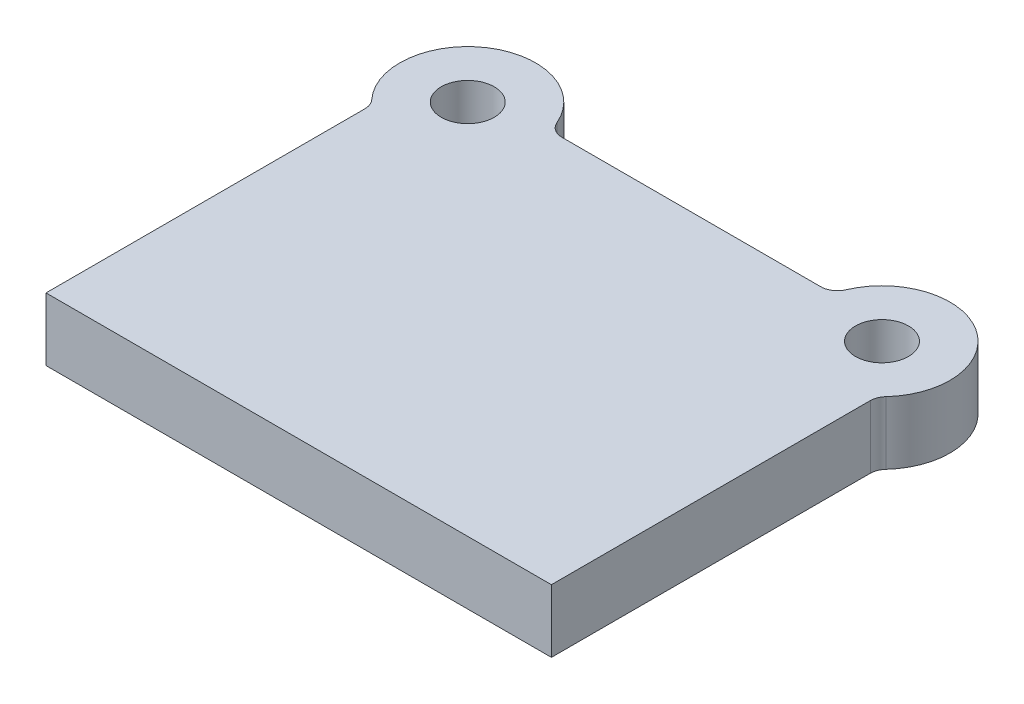
ISO-10303-21;
HEADER;
FILE_DESCRIPTION(('STEP AP214'),'2;1');
FILE_NAME('part.step','',(''),(''),'','','');
FILE_SCHEMA(('AUTOMOTIVE_DESIGN { 1 0 10303 214 1 1 1 1 }'));
ENDSEC;
DATA;
#1=APPLICATION_CONTEXT('core data for automotive mechanical design processes');
#2=APPLICATION_PROTOCOL_DEFINITION('international standard','automotive_design',2000,#1);
#3=PRODUCT_CONTEXT('',#1,'mechanical');
#4=PRODUCT('Part','Part','',(#3));
#5=PRODUCT_RELATED_PRODUCT_CATEGORY('part','',(#4));
#6=PRODUCT_DEFINITION_FORMATION('','',#4);
#7=PRODUCT_DEFINITION_CONTEXT('part definition',#1,'design');
#8=PRODUCT_DEFINITION('design','',#6,#7);
#9=PRODUCT_DEFINITION_SHAPE('','',#8);
#10=(LENGTH_UNIT() NAMED_UNIT(*) SI_UNIT(.MILLI.,.METRE.));
#11=(NAMED_UNIT(*) PLANE_ANGLE_UNIT() SI_UNIT($,.RADIAN.));
#12=(NAMED_UNIT(*) SI_UNIT($,.STERADIAN.) SOLID_ANGLE_UNIT());
#13=UNCERTAINTY_MEASURE_WITH_UNIT(LENGTH_MEASURE(1.E-05),#10,'distance_accuracy_value','');
#14=(GEOMETRIC_REPRESENTATION_CONTEXT(3) GLOBAL_UNCERTAINTY_ASSIGNED_CONTEXT((#13)) GLOBAL_UNIT_ASSIGNED_CONTEXT((#10,
#11,#12)) REPRESENTATION_CONTEXT('',''));
#15=CARTESIAN_POINT('',(0.,0.,0.));
#16=DIRECTION('',(0.,0.,1.));
#17=DIRECTION('',(1.,0.,0.));
#18=AXIS2_PLACEMENT_3D('',#15,#16,#17);
#19=CARTESIAN_POINT('',(-125.,38.,-227.));
#20=DIRECTION('',(0.,1.,0.));
#21=DIRECTION('',(0.,0.,1.));
#22=AXIS2_PLACEMENT_3D('',#19,#20,#21);
#23=PLANE('',#22);
#24=CARTESIAN_POINT('',(-125.,38.,-227.));
#25=DIRECTION('',(0.,1.,0.));
#26=DIRECTION('',(0.,0.,1.));
#27=AXIS2_PLACEMENT_3D('',#24,#25,#26);
#28=CIRCLE('',#27,16.);
#29=CARTESIAN_POINT('',(-125.,38.,-211.));
#30=VERTEX_POINT('',#29);
#31=EDGE_CURVE('E195',#30,#30,#28,.T.);
#32=ORIENTED_EDGE('',*,*,#31,.F.);
#33=EDGE_LOOP('',(#32));
#34=FACE_BOUND('',#33,.T.);
#35=CARTESIAN_POINT('',(-125.,38.,-227.));
#36=DIRECTION('',(0.,1.,0.));
#37=DIRECTION('',(0.,0.,1.));
#38=AXIS2_PLACEMENT_3D('',#35,#36,#37);
#39=CIRCLE('',#38,41.);
#40=CARTESIAN_POINT('',(-87.2841671893854,38.,-243.078431372549));
#41=VERTEX_POINT('',#40);
#42=CARTESIAN_POINT('',(-155.147058823529,38.,-199.212325676828));
#43=VERTEX_POINT('',#42);
#44=EDGE_CURVE('E141',#41,#43,#39,.T.);
#45=ORIENTED_EDGE('',*,*,#44,.T.);
#46=CARTESIAN_POINT('',(-162.5,38.,-192.434844134591));
#47=DIRECTION('',(0.,1.,0.));
#48=DIRECTION('',(0.,0.,1.));
#49=AXIS2_PLACEMENT_3D('',#46,#47,#48);
#50=CIRCLE('',#49,10.);
#51=CARTESIAN_POINT('',(-152.5,38.,-192.434844134591));
#52=VERTEX_POINT('',#51);
#53=EDGE_CURVE('E117',#43,#52,#50,.F.);
#54=ORIENTED_EDGE('',*,*,#53,.T.);
#55=DIRECTION('',(0.,0.,1.));
#56=VECTOR('',#55,1.);
#57=CARTESIAN_POINT('',(-152.5,38.,0.));
#58=LINE('',#57,#56);
#59=CARTESIAN_POINT('',(-152.5,38.,0.));
#60=VERTEX_POINT('',#59);
#61=EDGE_CURVE('E109',#52,#60,#58,.T.);
#62=ORIENTED_EDGE('',*,*,#61,.T.);
#63=DIRECTION('',(1.,0.,0.));
#64=VECTOR('',#63,1.);
#65=CARTESIAN_POINT('',(152.5,38.,0.));
#66=LINE('',#65,#64);
#67=CARTESIAN_POINT('',(152.5,38.,0.));
#68=VERTEX_POINT('',#67);
#69=EDGE_CURVE('E114',#60,#68,#66,.T.);
#70=ORIENTED_EDGE('',*,*,#69,.T.);
#71=DIRECTION('',(0.,0.,-1.));
#72=VECTOR('',#71,1.);
#73=CARTESIAN_POINT('',(152.5,38.,0.));
#74=LINE('',#73,#72);
#75=CARTESIAN_POINT('',(152.5,38.,-192.434844134591));
#76=VERTEX_POINT('',#75);
#77=EDGE_CURVE('E131',#68,#76,#74,.T.);
#78=ORIENTED_EDGE('',*,*,#77,.T.);
#79=CARTESIAN_POINT('',(162.5,38.,-192.434844134591));
#80=DIRECTION('',(0.,1.,0.));
#81=DIRECTION('',(0.,0.,1.));
#82=AXIS2_PLACEMENT_3D('',#79,#80,#81);
#83=CIRCLE('',#82,10.);
#84=CARTESIAN_POINT('',(155.147058823529,38.,-199.212325676828));
#85=VERTEX_POINT('',#84);
#86=EDGE_CURVE('E162',#76,#85,#83,.F.);
#87=ORIENTED_EDGE('',*,*,#86,.T.);
#88=CARTESIAN_POINT('',(125.,38.,-227.));
#89=DIRECTION('',(0.,1.,0.));
#90=DIRECTION('',(0.,0.,-1.));
#91=AXIS2_PLACEMENT_3D('',#88,#89,#90);
#92=CIRCLE('',#91,41.);
#93=CARTESIAN_POINT('',(87.2841671893854,38.,-243.078431372549));
#94=VERTEX_POINT('',#93);
#95=EDGE_CURVE('E189',#85,#94,#92,.T.);
#96=ORIENTED_EDGE('',*,*,#95,.T.);
#97=CARTESIAN_POINT('',(78.0851835770404,38.,-247.));
#98=DIRECTION('',(0.,1.,0.));
#99=DIRECTION('',(0.,0.,1.));
#100=AXIS2_PLACEMENT_3D('',#97,#98,#99);
#101=CIRCLE('',#100,10.);
#102=CARTESIAN_POINT('',(78.0851835770404,38.,-237.));
#103=VERTEX_POINT('',#102);
#104=EDGE_CURVE('E55',#94,#103,#101,.F.);
#105=ORIENTED_EDGE('',*,*,#104,.T.);
#106=DIRECTION('',(-1.,0.,0.));
#107=VECTOR('',#106,1.);
#108=CARTESIAN_POINT('',(85.2382092958579,38.,-237.));
#109=LINE('',#108,#107);
#110=CARTESIAN_POINT('',(-78.0851835770404,38.,-237.));
#111=VERTEX_POINT('',#110);
#112=EDGE_CURVE('E184',#103,#111,#109,.T.);
#113=ORIENTED_EDGE('',*,*,#112,.T.);
#114=CARTESIAN_POINT('',(-78.0851835770404,38.,-247.));
#115=DIRECTION('',(0.,1.,0.));
#116=DIRECTION('',(0.,0.,1.));
#117=AXIS2_PLACEMENT_3D('',#114,#115,#116);
#118=CIRCLE('',#117,10.);
#119=EDGE_CURVE('E11',#111,#41,#118,.F.);
#120=ORIENTED_EDGE('',*,*,#119,.T.);
#121=EDGE_LOOP('',(#45,#54,#62,#70,#78,#87,#96,#105,#113,#120));
#122=FACE_BOUND('',#121,.T.);
#123=CARTESIAN_POINT('',(125.,38.,-227.));
#124=DIRECTION('',(0.,1.,0.));
#125=DIRECTION('',(0.,0.,-1.));
#126=AXIS2_PLACEMENT_3D('',#123,#124,#125);
#127=CIRCLE('',#126,16.);
#128=CARTESIAN_POINT('',(125.,38.,-243.));
#129=VERTEX_POINT('',#128);
#130=EDGE_CURVE('E213',#129,#129,#127,.T.);
#131=ORIENTED_EDGE('',*,*,#130,.F.);
#132=EDGE_LOOP('',(#131));
#133=FACE_BOUND('',#132,.T.);
#134=ADVANCED_FACE('F33',(#34,#122,#133),#23,.T.);
#135=CARTESIAN_POINT('',(-125.,0.,-227.));
#136=DIRECTION('',(0.,1.,0.));
#137=DIRECTION('',(0.,0.,1.));
#138=AXIS2_PLACEMENT_3D('',#135,#136,#137);
#139=PLANE('',#138);
#140=DIRECTION('',(0.,0.,1.));
#141=VECTOR('',#140,1.);
#142=CARTESIAN_POINT('',(-152.5,0.,0.));
#143=LINE('',#142,#141);
#144=CARTESIAN_POINT('',(-152.5,0.,-192.434844134591));
#145=VERTEX_POINT('',#144);
#146=CARTESIAN_POINT('',(-152.5,0.,0.));
#147=VERTEX_POINT('',#146);
#148=EDGE_CURVE('E135',#145,#147,#143,.T.);
#149=ORIENTED_EDGE('',*,*,#148,.F.);
#150=CARTESIAN_POINT('',(-162.5,0.,-192.434844134591));
#151=DIRECTION('',(0.,1.,0.));
#152=DIRECTION('',(0.,0.,1.));
#153=AXIS2_PLACEMENT_3D('',#150,#151,#152);
#154=CIRCLE('',#153,10.);
#155=CARTESIAN_POINT('',(-155.147058823529,0.,-199.212325676828));
#156=VERTEX_POINT('',#155);
#157=EDGE_CURVE('E164',#145,#156,#154,.T.);
#158=ORIENTED_EDGE('',*,*,#157,.T.);
#159=CARTESIAN_POINT('',(-125.,0.,-227.));
#160=DIRECTION('',(0.,1.,0.));
#161=DIRECTION('',(0.,0.,1.));
#162=AXIS2_PLACEMENT_3D('',#159,#160,#161);
#163=CIRCLE('',#162,41.);
#164=CARTESIAN_POINT('',(-87.2841671893854,0.,-243.078431372549));
#165=VERTEX_POINT('',#164);
#166=EDGE_CURVE('E122',#165,#156,#163,.T.);
#167=ORIENTED_EDGE('',*,*,#166,.F.);
#168=CARTESIAN_POINT('',(-78.0851835770404,0.,-247.));
#169=DIRECTION('',(0.,1.,0.));
#170=DIRECTION('',(0.,0.,1.));
#171=AXIS2_PLACEMENT_3D('',#168,#169,#170);
#172=CIRCLE('',#171,10.);
#173=CARTESIAN_POINT('',(-78.0851835770404,0.,-237.));
#174=VERTEX_POINT('',#173);
#175=EDGE_CURVE('E41',#165,#174,#172,.T.);
#176=ORIENTED_EDGE('',*,*,#175,.T.);
#177=DIRECTION('',(-1.,0.,0.));
#178=VECTOR('',#177,1.);
#179=CARTESIAN_POINT('',(85.2382092958579,0.,-237.));
#180=LINE('',#179,#178);
#181=CARTESIAN_POINT('',(78.0851835770404,0.,-237.));
#182=VERTEX_POINT('',#181);
#183=EDGE_CURVE('E174',#182,#174,#180,.T.);
#184=ORIENTED_EDGE('',*,*,#183,.F.);
#185=CARTESIAN_POINT('',(78.0851835770404,0.,-247.));
#186=DIRECTION('',(0.,1.,0.));
#187=DIRECTION('',(0.,0.,1.));
#188=AXIS2_PLACEMENT_3D('',#185,#186,#187);
#189=CIRCLE('',#188,10.);
#190=CARTESIAN_POINT('',(87.2841671893854,0.,-243.078431372549));
#191=VERTEX_POINT('',#190);
#192=EDGE_CURVE('E167',#182,#191,#189,.T.);
#193=ORIENTED_EDGE('',*,*,#192,.T.);
#194=CARTESIAN_POINT('',(125.,0.,-227.));
#195=DIRECTION('',(0.,1.,0.));
#196=DIRECTION('',(0.,0.,-1.));
#197=AXIS2_PLACEMENT_3D('',#194,#195,#196);
#198=CIRCLE('',#197,41.);
#199=CARTESIAN_POINT('',(155.147058823529,0.,-199.212325676828));
#200=VERTEX_POINT('',#199);
#201=EDGE_CURVE('E180',#200,#191,#198,.T.);
#202=ORIENTED_EDGE('',*,*,#201,.F.);
#203=CARTESIAN_POINT('',(162.5,0.,-192.434844134591));
#204=DIRECTION('',(0.,1.,0.));
#205=DIRECTION('',(0.,0.,1.));
#206=AXIS2_PLACEMENT_3D('',#203,#204,#205);
#207=CIRCLE('',#206,10.);
#208=CARTESIAN_POINT('',(152.5,0.,-192.434844134591));
#209=VERTEX_POINT('',#208);
#210=EDGE_CURVE('E160',#200,#209,#207,.T.);
#211=ORIENTED_EDGE('',*,*,#210,.T.);
#212=DIRECTION('',(0.,0.,-1.));
#213=VECTOR('',#212,1.);
#214=CARTESIAN_POINT('',(152.5,0.,0.));
#215=LINE('',#214,#213);
#216=CARTESIAN_POINT('',(152.5,0.,0.));
#217=VERTEX_POINT('',#216);
#218=EDGE_CURVE('E197',#217,#209,#215,.T.);
#219=ORIENTED_EDGE('',*,*,#218,.F.);
#220=DIRECTION('',(1.,0.,0.));
#221=VECTOR('',#220,1.);
#222=CARTESIAN_POINT('',(152.5,0.,0.));
#223=LINE('',#222,#221);
#224=EDGE_CURVE('E194',#147,#217,#223,.T.);
#225=ORIENTED_EDGE('',*,*,#224,.F.);
#226=EDGE_LOOP('',(#149,#158,#167,#176,#184,#193,#202,#211,#219,#225));
#227=FACE_BOUND('',#226,.T.);
#228=CARTESIAN_POINT('',(-125.,0.,-227.));
#229=DIRECTION('',(0.,1.,0.));
#230=DIRECTION('',(0.,0.,1.));
#231=AXIS2_PLACEMENT_3D('',#228,#229,#230);
#232=CIRCLE('',#231,16.);
#233=CARTESIAN_POINT('',(-125.,0.,-211.));
#234=VERTEX_POINT('',#233);
#235=EDGE_CURVE('E210',#234,#234,#232,.T.);
#236=ORIENTED_EDGE('',*,*,#235,.T.);
#237=EDGE_LOOP('',(#236));
#238=FACE_BOUND('',#237,.T.);
#239=CARTESIAN_POINT('',(125.,0.,-227.));
#240=DIRECTION('',(0.,1.,0.));
#241=DIRECTION('',(0.,0.,-1.));
#242=AXIS2_PLACEMENT_3D('',#239,#240,#241);
#243=CIRCLE('',#242,16.);
#244=CARTESIAN_POINT('',(125.,0.,-243.));
#245=VERTEX_POINT('',#244);
#246=EDGE_CURVE('E216',#245,#245,#243,.T.);
#247=ORIENTED_EDGE('',*,*,#246,.T.);
#248=EDGE_LOOP('',(#247));
#249=FACE_BOUND('',#248,.T.);
#250=ADVANCED_FACE('F172',(#227,#238,#249),#139,.F.);
#251=CARTESIAN_POINT('',(-152.5,38.,0.));
#252=DIRECTION('',(1.,0.,0.));
#253=DIRECTION('',(0.,0.,-1.));
#254=AXIS2_PLACEMENT_3D('',#251,#252,#253);
#255=PLANE('',#254);
#256=ORIENTED_EDGE('',*,*,#61,.F.);
#257=DIRECTION('',(0.,1.,0.));
#258=VECTOR('',#257,1.);
#259=CARTESIAN_POINT('',(-152.5,0.,-192.434844134591));
#260=LINE('',#259,#258);
#261=EDGE_CURVE('E149',#52,#145,#260,.F.);
#262=ORIENTED_EDGE('',*,*,#261,.T.);
#263=ORIENTED_EDGE('',*,*,#148,.T.);
#264=DIRECTION('',(0.,-1.,0.));
#265=VECTOR('',#264,1.);
#266=CARTESIAN_POINT('',(-152.5,38.,0.));
#267=LINE('',#266,#265);
#268=EDGE_CURVE('E127',#60,#147,#267,.T.);
#269=ORIENTED_EDGE('',*,*,#268,.F.);
#270=EDGE_LOOP('',(#256,#262,#263,#269));
#271=FACE_BOUND('',#270,.T.);
#272=ADVANCED_FACE('F133',(#271),#255,.F.);
#273=CARTESIAN_POINT('',(152.5,38.,0.));
#274=DIRECTION('',(0.,0.,-1.));
#275=DIRECTION('',(-1.,0.,0.));
#276=AXIS2_PLACEMENT_3D('',#273,#274,#275);
#277=PLANE('',#276);
#278=ORIENTED_EDGE('',*,*,#224,.T.);
#279=DIRECTION('',(0.,-1.,0.));
#280=VECTOR('',#279,1.);
#281=CARTESIAN_POINT('',(152.5,38.,0.));
#282=LINE('',#281,#280);
#283=EDGE_CURVE('E129',#68,#217,#282,.T.);
#284=ORIENTED_EDGE('',*,*,#283,.F.);
#285=ORIENTED_EDGE('',*,*,#69,.F.);
#286=ORIENTED_EDGE('',*,*,#268,.T.);
#287=EDGE_LOOP('',(#278,#284,#285,#286));
#288=FACE_BOUND('',#287,.T.);
#289=ADVANCED_FACE('F126',(#288),#277,.F.);
#290=CARTESIAN_POINT('',(152.5,38.,0.));
#291=DIRECTION('',(-1.,0.,0.));
#292=DIRECTION('',(0.,0.,1.));
#293=AXIS2_PLACEMENT_3D('',#290,#291,#292);
#294=PLANE('',#293);
#295=ORIENTED_EDGE('',*,*,#218,.T.);
#296=DIRECTION('',(0.,1.,0.));
#297=VECTOR('',#296,1.);
#298=CARTESIAN_POINT('',(152.5,38.,-192.434844134591));
#299=LINE('',#298,#297);
#300=EDGE_CURVE('E147',#209,#76,#299,.T.);
#301=ORIENTED_EDGE('',*,*,#300,.T.);
#302=ORIENTED_EDGE('',*,*,#77,.F.);
#303=ORIENTED_EDGE('',*,*,#283,.T.);
#304=EDGE_LOOP('',(#295,#301,#302,#303));
#305=FACE_BOUND('',#304,.T.);
#306=ADVANCED_FACE('F205',(#305),#294,.F.);
#307=CARTESIAN_POINT('',(125.,38.,-227.));
#308=DIRECTION('',(0.,-1.,0.));
#309=DIRECTION('',(0.,0.,-1.));
#310=AXIS2_PLACEMENT_3D('',#307,#308,#309);
#311=CYLINDRICAL_SURFACE('',#310,41.);
#312=ORIENTED_EDGE('',*,*,#95,.F.);
#313=DIRECTION('',(0.,-1.,0.));
#314=VECTOR('',#313,1.);
#315=CARTESIAN_POINT('',(155.147058823529,38.,-199.212325676828));
#316=LINE('',#315,#314);
#317=EDGE_CURVE('E139',#85,#200,#316,.T.);
#318=ORIENTED_EDGE('',*,*,#317,.T.);
#319=ORIENTED_EDGE('',*,*,#201,.T.);
#320=DIRECTION('',(0.,-1.,0.));
#321=VECTOR('',#320,1.);
#322=CARTESIAN_POINT('',(87.2841671893854,38.,-243.078431372549));
#323=LINE('',#322,#321);
#324=EDGE_CURVE('E137',#191,#94,#323,.F.);
#325=ORIENTED_EDGE('',*,*,#324,.T.);
#326=EDGE_LOOP('',(#312,#318,#319,#325));
#327=FACE_BOUND('',#326,.T.);
#328=ADVANCED_FACE('F240',(#327),#311,.T.);
#329=CARTESIAN_POINT('',(85.2382092958579,38.,-237.));
#330=DIRECTION('',(0.,0.,1.));
#331=DIRECTION('',(1.,0.,0.));
#332=AXIS2_PLACEMENT_3D('',#329,#330,#331);
#333=PLANE('',#332);
#334=ORIENTED_EDGE('',*,*,#112,.F.);
#335=DIRECTION('',(0.,1.,0.));
#336=VECTOR('',#335,1.);
#337=CARTESIAN_POINT('',(78.0851835770404,0.,-237.));
#338=LINE('',#337,#336);
#339=EDGE_CURVE('E157',#103,#182,#338,.F.);
#340=ORIENTED_EDGE('',*,*,#339,.T.);
#341=ORIENTED_EDGE('',*,*,#183,.T.);
#342=DIRECTION('',(0.,1.,0.));
#343=VECTOR('',#342,1.);
#344=CARTESIAN_POINT('',(-78.0851835770404,38.,-237.));
#345=LINE('',#344,#343);
#346=EDGE_CURVE('E48',#174,#111,#345,.T.);
#347=ORIENTED_EDGE('',*,*,#346,.T.);
#348=EDGE_LOOP('',(#334,#340,#341,#347));
#349=FACE_BOUND('',#348,.T.);
#350=ADVANCED_FACE('F178',(#349),#333,.F.);
#351=CARTESIAN_POINT('',(-125.,38.,-227.));
#352=DIRECTION('',(0.,-1.,0.));
#353=DIRECTION('',(0.,0.,-1.));
#354=AXIS2_PLACEMENT_3D('',#351,#352,#353);
#355=CYLINDRICAL_SURFACE('',#354,41.);
#356=ORIENTED_EDGE('',*,*,#166,.T.);
#357=DIRECTION('',(0.,-1.,0.));
#358=VECTOR('',#357,1.);
#359=CARTESIAN_POINT('',(-155.147058823529,38.,-199.212325676828));
#360=LINE('',#359,#358);
#361=EDGE_CURVE('E154',#156,#43,#360,.F.);
#362=ORIENTED_EDGE('',*,*,#361,.T.);
#363=ORIENTED_EDGE('',*,*,#44,.F.);
#364=DIRECTION('',(0.,-1.,0.));
#365=VECTOR('',#364,1.);
#366=CARTESIAN_POINT('',(-87.2841671893854,38.,-243.078431372549));
#367=LINE('',#366,#365);
#368=EDGE_CURVE('E151',#41,#165,#367,.T.);
#369=ORIENTED_EDGE('',*,*,#368,.T.);
#370=EDGE_LOOP('',(#356,#362,#363,#369));
#371=FACE_BOUND('',#370,.T.);
#372=ADVANCED_FACE('F186',(#371),#355,.T.);
#373=CARTESIAN_POINT('',(-125.,38.,-227.));
#374=DIRECTION('',(0.,-1.,0.));
#375=DIRECTION('',(0.,0.,-1.));
#376=AXIS2_PLACEMENT_3D('',#373,#374,#375);
#377=CYLINDRICAL_SURFACE('',#376,16.);
#378=ORIENTED_EDGE('',*,*,#31,.T.);
#379=EDGE_LOOP('',(#378));
#380=FACE_BOUND('',#379,.T.);
#381=ORIENTED_EDGE('',*,*,#235,.F.);
#382=EDGE_LOOP('',(#381));
#383=FACE_BOUND('',#382,.T.);
#384=ADVANCED_FACE('F233',(#380,#383),#377,.F.);
#385=CARTESIAN_POINT('',(125.,38.,-227.));
#386=DIRECTION('',(0.,-1.,0.));
#387=DIRECTION('',(0.,0.,-1.));
#388=AXIS2_PLACEMENT_3D('',#385,#386,#387);
#389=CYLINDRICAL_SURFACE('',#388,16.);
#390=ORIENTED_EDGE('',*,*,#130,.T.);
#391=EDGE_LOOP('',(#390));
#392=FACE_BOUND('',#391,.T.);
#393=ORIENTED_EDGE('',*,*,#246,.F.);
#394=EDGE_LOOP('',(#393));
#395=FACE_BOUND('',#394,.T.);
#396=ADVANCED_FACE('F222',(#392,#395),#389,.F.);
#397=CARTESIAN_POINT('',(162.5,38.,-192.434844134591));
#398=DIRECTION('',(0.,-1.,0.));
#399=DIRECTION('',(0.,0.,-1.));
#400=AXIS2_PLACEMENT_3D('',#397,#398,#399);
#401=CYLINDRICAL_SURFACE('',#400,10.);
#402=ORIENTED_EDGE('',*,*,#86,.F.);
#403=ORIENTED_EDGE('',*,*,#300,.F.);
#404=ORIENTED_EDGE('',*,*,#210,.F.);
#405=ORIENTED_EDGE('',*,*,#317,.F.);
#406=EDGE_LOOP('',(#402,#403,#404,#405));
#407=FACE_BOUND('',#406,.T.);
#408=ADVANCED_FACE('F250',(#407),#401,.F.);
#409=CARTESIAN_POINT('',(-162.5,38.,-192.434844134591));
#410=DIRECTION('',(0.,-1.,0.));
#411=DIRECTION('',(0.,0.,-1.));
#412=AXIS2_PLACEMENT_3D('',#409,#410,#411);
#413=CYLINDRICAL_SURFACE('',#412,10.);
#414=ORIENTED_EDGE('',*,*,#53,.F.);
#415=ORIENTED_EDGE('',*,*,#361,.F.);
#416=ORIENTED_EDGE('',*,*,#157,.F.);
#417=ORIENTED_EDGE('',*,*,#261,.F.);
#418=EDGE_LOOP('',(#414,#415,#416,#417));
#419=FACE_BOUND('',#418,.T.);
#420=ADVANCED_FACE('F202',(#419),#413,.F.);
#421=CARTESIAN_POINT('',(78.0851835770404,38.,-247.));
#422=DIRECTION('',(0.,-1.,0.));
#423=DIRECTION('',(0.,0.,-1.));
#424=AXIS2_PLACEMENT_3D('',#421,#422,#423);
#425=CYLINDRICAL_SURFACE('',#424,10.);
#426=ORIENTED_EDGE('',*,*,#104,.F.);
#427=ORIENTED_EDGE('',*,*,#324,.F.);
#428=ORIENTED_EDGE('',*,*,#192,.F.);
#429=ORIENTED_EDGE('',*,*,#339,.F.);
#430=EDGE_LOOP('',(#426,#427,#428,#429));
#431=FACE_BOUND('',#430,.T.);
#432=ADVANCED_FACE('F255',(#431),#425,.F.);
#433=CARTESIAN_POINT('',(-78.0851835770404,38.,-247.));
#434=DIRECTION('',(0.,-1.,0.));
#435=DIRECTION('',(0.,0.,-1.));
#436=AXIS2_PLACEMENT_3D('',#433,#434,#435);
#437=CYLINDRICAL_SURFACE('',#436,10.);
#438=ORIENTED_EDGE('',*,*,#119,.F.);
#439=ORIENTED_EDGE('',*,*,#346,.F.);
#440=ORIENTED_EDGE('',*,*,#175,.F.);
#441=ORIENTED_EDGE('',*,*,#368,.F.);
#442=EDGE_LOOP('',(#438,#439,#440,#441));
#443=FACE_BOUND('',#442,.T.);
#444=ADVANCED_FACE('F35',(#443),#437,.F.);
#445=CLOSED_SHELL('',(#134,#250,#272,#289,#306,#328,#350,#372,#384,#396,#408,#420,#432,#444));
#446=MANIFOLD_SOLID_BREP('B2',#445);
#447=ADVANCED_BREP_SHAPE_REPRESENTATION('',(#18,#446),#14);
#448=SHAPE_DEFINITION_REPRESENTATION(#9,#447);
ENDSEC;
END-ISO-10303-21;
